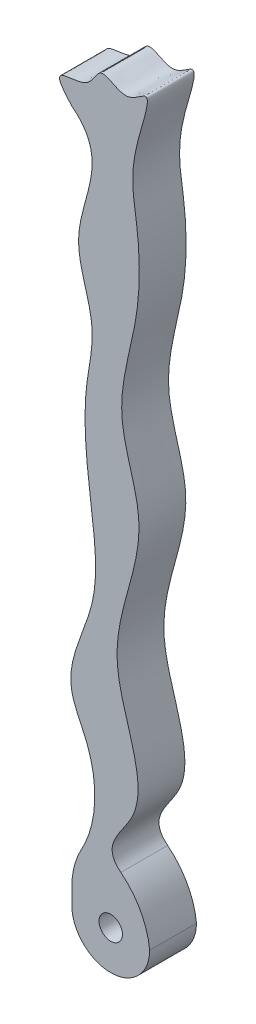
ISO-10303-21;
HEADER;
FILE_DESCRIPTION(('STEP AP214'),'2;1');
FILE_NAME('part.step','',(''),(''),'','','');
FILE_SCHEMA(('AUTOMOTIVE_DESIGN { 1 0 10303 214 1 1 1 1 }'));
ENDSEC;
DATA;
#1=APPLICATION_CONTEXT('core data for automotive mechanical design processes');
#2=APPLICATION_PROTOCOL_DEFINITION('international standard','automotive_design',2000,#1);
#3=PRODUCT_CONTEXT('',#1,'mechanical');
#4=PRODUCT('Part','Part','',(#3));
#5=PRODUCT_RELATED_PRODUCT_CATEGORY('part','',(#4));
#6=PRODUCT_DEFINITION_FORMATION('','',#4);
#7=PRODUCT_DEFINITION_CONTEXT('part definition',#1,'design');
#8=PRODUCT_DEFINITION('design','',#6,#7);
#9=PRODUCT_DEFINITION_SHAPE('','',#8);
#10=(LENGTH_UNIT() NAMED_UNIT(*) SI_UNIT(.MILLI.,.METRE.));
#11=(NAMED_UNIT(*) PLANE_ANGLE_UNIT() SI_UNIT($,.RADIAN.));
#12=(NAMED_UNIT(*) SI_UNIT($,.STERADIAN.) SOLID_ANGLE_UNIT());
#13=UNCERTAINTY_MEASURE_WITH_UNIT(LENGTH_MEASURE(1.E-05),#10,'distance_accuracy_value','');
#14=(GEOMETRIC_REPRESENTATION_CONTEXT(3) GLOBAL_UNCERTAINTY_ASSIGNED_CONTEXT((#13)) GLOBAL_UNIT_ASSIGNED_CONTEXT((#10,
#11,#12)) REPRESENTATION_CONTEXT('',''));
#15=CARTESIAN_POINT('',(0.,0.,0.));
#16=DIRECTION('',(0.,0.,1.));
#17=DIRECTION('',(1.,0.,0.));
#18=AXIS2_PLACEMENT_3D('',#15,#16,#17);
#19=CARTESIAN_POINT('',(4.07432307287909,27.0040889400727,6.));
#20=DIRECTION('',(0.,0.,1.));
#21=DIRECTION('',(1.,0.,0.));
#22=AXIS2_PLACEMENT_3D('',#19,#20,#21);
#23=PLANE('',#22);
#24=CARTESIAN_POINT('',(4.99,-4.99,6.));
#25=DIRECTION('',(0.,0.,1.));
#26=DIRECTION('',(1.,0.,0.));
#27=AXIS2_PLACEMENT_3D('',#24,#25,#26);
#28=CIRCLE('',#27,1.5);
#29=CARTESIAN_POINT('',(6.49,-4.99,6.));
#30=VERTEX_POINT('',#29);
#31=EDGE_CURVE('E205',#30,#30,#28,.T.);
#32=ORIENTED_EDGE('',*,*,#31,.F.);
#33=EDGE_LOOP('',(#32));
#34=FACE_BOUND('',#33,.T.);
#35=CARTESIAN_POINT('',(0.,83.7242318277162,6.));
#36=CARTESIAN_POINT('',(5.30360451309012,79.6275511991297,6.));
#37=CARTESIAN_POINT('',(-1.72408284275798,71.1710610888068,6.));
#38=CARTESIAN_POINT('',(3.50687172415467,61.2106332077298,6.));
#39=CARTESIAN_POINT('',(1.01260111726702,51.3203743797408,6.));
#40=CARTESIAN_POINT('',(2.48456574438665,41.1283603197757,6.));
#41=CARTESIAN_POINT('',(3.80137678876694,29.3383759104623,6.));
#42=CARTESIAN_POINT('',(-1.78831888313615,20.5922250285312,6.));
#43=CARTESIAN_POINT('',(3.99004314904156,11.2809632428831,6.));
#44=CARTESIAN_POINT('',(3.12734891819012,3.88723837993776,6.));
#45=CARTESIAN_POINT('',(0.,0.,6.));
#46=B_SPLINE_CURVE_WITH_KNOTS('',3,(#35,#36,#37,#38,#39,#40,#41,#42,#43,#44,#45),.UNSPECIFIED.,
.F.,.F.,(4,1,1,1,1,1,1,1,4),(0.,0.178407715975721,0.282250632971705,0.360012871768497,
0.523096626866461,0.638532861503322,0.770288180663963,0.82976306952161,1.),.UNSPECIFIED.);
#47=CARTESIAN_POINT('',(0.,83.7242318277162,6.));
#48=VERTEX_POINT('',#47);
#49=CARTESIAN_POINT('',(1.24333810984433,1.85583155249955,6.));
#50=VERTEX_POINT('',#49);
#51=EDGE_CURVE('E136',#48,#50,#46,.T.);
#52=ORIENTED_EDGE('',*,*,#51,.T.);
#53=CARTESIAN_POINT('',(10.,-2.97333737615631,6.));
#54=DIRECTION('',(0.,0.,1.));
#55=DIRECTION('',(1.,0.,0.));
#56=AXIS2_PLACEMENT_3D('',#53,#54,#55);
#57=CIRCLE('',#56,10.);
#58=CARTESIAN_POINT('',(0.,-2.97333737615631,6.));
#59=VERTEX_POINT('',#58);
#60=EDGE_CURVE('E63',#50,#59,#57,.T.);
#61=ORIENTED_EDGE('',*,*,#60,.T.);
#62=DIRECTION('',(0.,-1.,0.));
#63=VECTOR('',#62,1.);
#64=CARTESIAN_POINT('',(0.,0.,6.));
#65=LINE('',#64,#63);
#66=CARTESIAN_POINT('',(0.,-4.99,6.));
#67=VERTEX_POINT('',#66);
#68=EDGE_CURVE('E109',#59,#67,#65,.T.);
#69=ORIENTED_EDGE('',*,*,#68,.T.);
#70=CARTESIAN_POINT('',(4.99,-4.99,6.));
#71=DIRECTION('',(0.,0.,-1.));
#72=DIRECTION('',(-1.,0.,0.));
#73=AXIS2_PLACEMENT_3D('',#70,#71,#72);
#74=CIRCLE('',#73,4.99);
#75=CARTESIAN_POINT('',(9.98,-4.99,6.));
#76=VERTEX_POINT('',#75);
#77=EDGE_CURVE('E111',#76,#67,#74,.T.);
#78=ORIENTED_EDGE('',*,*,#77,.F.);
#79=CARTESIAN_POINT('',(0.0310108964638543,-5.99876945716995,6.));
#80=DIRECTION('',(0.,0.,1.));
#81=DIRECTION('',(1.,0.,0.));
#82=AXIS2_PLACEMENT_3D('',#79,#80,#81);
#83=CIRCLE('',#82,10.);
#84=CARTESIAN_POINT('',(6.29125303537323,1.79926672909024,6.));
#85=VERTEX_POINT('',#84);
#86=EDGE_CURVE('E70',#76,#85,#83,.T.);
#87=ORIENTED_EDGE('',*,*,#86,.T.);
#88=CARTESIAN_POINT('',(9.98,0.,6.));
#89=CARTESIAN_POINT('',(1.82735639435472,2.77603669074244,6.));
#90=CARTESIAN_POINT('',(12.6284584082559,9.59933235837442,6.));
#91=CARTESIAN_POINT('',(2.06869458009947,25.5354900622314,6.));
#92=CARTESIAN_POINT('',(11.0705962110833,39.679531963617,6.));
#93=CARTESIAN_POINT('',(4.76134769084272,53.0945780205617,6.));
#94=CARTESIAN_POINT('',(8.90482224707103,63.6142178871551,6.));
#95=CARTESIAN_POINT('',(8.63400219004494,74.9890039805902,6.));
#96=CARTESIAN_POINT('',(6.94132405017827,80.9305998095854,6.));
#97=CARTESIAN_POINT('',(10.9107914530873,91.3305026743746,6.));
#98=CARTESIAN_POINT('',(6.7403174797081,87.2564779415208,6.));
#99=CARTESIAN_POINT('',(3.67621995962517,90.4939468582485,6.));
#100=CARTESIAN_POINT('',(1.87598491500181,85.2699856212088,6.));
#101=CARTESIAN_POINT('',(-3.8601205014058,87.8931590609359,6.));
#102=CARTESIAN_POINT('',(0.,83.7242318277162,6.));
#103=B_SPLINE_CURVE_WITH_KNOTS('',3,(#88,#89,#90,#91,#92,#93,#94,#95,#96,#97,#98,#99,#100,#101,
#102),.UNSPECIFIED.,.F.,.F.,(4,1,1,1,1,1,1,1,1,1,1,1,4),(0.,0.100682732287423,0.250611548367926,
0.416415763417225,0.510336756842132,0.633096865303225,0.721240759906963,0.807038287311499,
0.861395625064534,0.884668407627723,0.916983233993869,0.938691149651532,1.),.UNSPECIFIED.);
#104=EDGE_CURVE('E143',#85,#48,#103,.T.);
#105=ORIENTED_EDGE('',*,*,#104,.T.);
#106=EDGE_LOOP('',(#52,#61,#69,#78,#87,#105));
#107=FACE_BOUND('',#106,.T.);
#108=ADVANCED_FACE('F55',(#34,#107),#23,.T.);
#109=CARTESIAN_POINT('',(4.07432307287909,27.0040889400727,0.));
#110=DIRECTION('',(0.,0.,1.));
#111=DIRECTION('',(1.,0.,0.));
#112=AXIS2_PLACEMENT_3D('',#109,#110,#111);
#113=PLANE('',#112);
#114=CARTESIAN_POINT('',(4.99,-4.99,0.));
#115=DIRECTION('',(0.,0.,1.));
#116=DIRECTION('',(1.,0.,0.));
#117=AXIS2_PLACEMENT_3D('',#114,#115,#116);
#118=CIRCLE('',#117,1.5);
#119=CARTESIAN_POINT('',(6.49,-4.99,0.));
#120=VERTEX_POINT('',#119);
#121=EDGE_CURVE('E202',#120,#120,#118,.T.);
#122=ORIENTED_EDGE('',*,*,#121,.T.);
#123=EDGE_LOOP('',(#122));
#124=FACE_BOUND('',#123,.T.);
#125=DIRECTION('',(0.,-1.,0.));
#126=VECTOR('',#125,1.);
#127=CARTESIAN_POINT('',(0.,0.,0.));
#128=LINE('',#127,#126);
#129=CARTESIAN_POINT('',(0.,-2.97333737615631,0.));
#130=VERTEX_POINT('',#129);
#131=CARTESIAN_POINT('',(0.,-4.99,0.));
#132=VERTEX_POINT('',#131);
#133=EDGE_CURVE('E118',#130,#132,#128,.T.);
#134=ORIENTED_EDGE('',*,*,#133,.F.);
#135=CARTESIAN_POINT('',(10.,-2.97333737615631,0.));
#136=DIRECTION('',(0.,0.,1.));
#137=DIRECTION('',(1.,0.,0.));
#138=AXIS2_PLACEMENT_3D('',#135,#136,#137);
#139=CIRCLE('',#138,10.);
#140=CARTESIAN_POINT('',(1.24333810984433,1.85583155249955,0.));
#141=VERTEX_POINT('',#140);
#142=EDGE_CURVE('E195',#130,#141,#139,.F.);
#143=ORIENTED_EDGE('',*,*,#142,.T.);
#144=CARTESIAN_POINT('',(0.,83.7242318277162,0.));
#145=CARTESIAN_POINT('',(5.30360451309012,79.6275511991297,0.));
#146=CARTESIAN_POINT('',(-1.72408284275798,71.1710610888068,0.));
#147=CARTESIAN_POINT('',(3.50687172415467,61.2106332077298,0.));
#148=CARTESIAN_POINT('',(1.01260111726702,51.3203743797408,0.));
#149=CARTESIAN_POINT('',(2.48456574438665,41.1283603197757,0.));
#150=CARTESIAN_POINT('',(3.80137678876694,29.3383759104623,0.));
#151=CARTESIAN_POINT('',(-1.78831888313615,20.5922250285312,0.));
#152=CARTESIAN_POINT('',(3.99004314904156,11.2809632428831,0.));
#153=CARTESIAN_POINT('',(3.12734891819012,3.88723837993776,0.));
#154=CARTESIAN_POINT('',(0.,0.,0.));
#155=B_SPLINE_CURVE_WITH_KNOTS('',3,(#144,#145,#146,#147,#148,#149,#150,#151,#152,#153,#154),
.UNSPECIFIED.,.F.,.F.,(4,1,1,1,1,1,1,1,4),(0.,0.178407715975721,0.282250632971705,
0.360012871768497,0.523096626866461,0.638532861503322,0.770288180663963,0.82976306952161,1.),.UNSPECIFIED.);
#156=CARTESIAN_POINT('',(0.,83.7242318277162,0.));
#157=VERTEX_POINT('',#156);
#158=EDGE_CURVE('E137',#157,#141,#155,.T.);
#159=ORIENTED_EDGE('',*,*,#158,.F.);
#160=CARTESIAN_POINT('',(9.98,0.,0.));
#161=CARTESIAN_POINT('',(1.82735639435472,2.77603669074244,0.));
#162=CARTESIAN_POINT('',(12.6284584082559,9.59933235837442,0.));
#163=CARTESIAN_POINT('',(2.06869458009947,25.5354900622314,0.));
#164=CARTESIAN_POINT('',(11.0705962110833,39.679531963617,0.));
#165=CARTESIAN_POINT('',(4.76134769084272,53.0945780205617,0.));
#166=CARTESIAN_POINT('',(8.90482224707103,63.6142178871551,0.));
#167=CARTESIAN_POINT('',(8.63400219004494,74.9890039805902,0.));
#168=CARTESIAN_POINT('',(6.94132405017827,80.9305998095854,0.));
#169=CARTESIAN_POINT('',(10.9107914530873,91.3305026743746,0.));
#170=CARTESIAN_POINT('',(6.7403174797081,87.2564779415208,0.));
#171=CARTESIAN_POINT('',(3.67621995962517,90.4939468582485,0.));
#172=CARTESIAN_POINT('',(1.87598491500181,85.2699856212088,0.));
#173=CARTESIAN_POINT('',(-3.8601205014058,87.8931590609359,0.));
#174=CARTESIAN_POINT('',(0.,83.7242318277162,0.));
#175=B_SPLINE_CURVE_WITH_KNOTS('',3,(#160,#161,#162,#163,#164,#165,#166,#167,#168,#169,#170,
#171,#172,#173,#174),.UNSPECIFIED.,.F.,.F.,(4,1,1,1,1,1,1,1,1,1,1,1,4),(0.,0.100682732287423,
0.250611548367926,0.416415763417225,0.510336756842132,0.633096865303225,0.721240759906963,
0.807038287311499,0.861395625064534,0.884668407627723,0.916983233993869,0.938691149651532,1.),.UNSPECIFIED.);
#176=CARTESIAN_POINT('',(6.29125303537323,1.79926672909024,0.));
#177=VERTEX_POINT('',#176);
#178=EDGE_CURVE('E142',#177,#157,#175,.T.);
#179=ORIENTED_EDGE('',*,*,#178,.F.);
#180=CARTESIAN_POINT('',(0.0310108964638543,-5.99876945716995,0.));
#181=DIRECTION('',(0.,0.,1.));
#182=DIRECTION('',(1.,0.,0.));
#183=AXIS2_PLACEMENT_3D('',#180,#181,#182);
#184=CIRCLE('',#183,10.);
#185=CARTESIAN_POINT('',(9.98,-4.99,0.));
#186=VERTEX_POINT('',#185);
#187=EDGE_CURVE('E192',#177,#186,#184,.F.);
#188=ORIENTED_EDGE('',*,*,#187,.T.);
#189=CARTESIAN_POINT('',(4.99,-4.99,0.));
#190=DIRECTION('',(0.,0.,-1.));
#191=DIRECTION('',(-1.,0.,0.));
#192=AXIS2_PLACEMENT_3D('',#189,#190,#191);
#193=CIRCLE('',#192,4.99);
#194=EDGE_CURVE('E127',#186,#132,#193,.T.);
#195=ORIENTED_EDGE('',*,*,#194,.T.);
#196=EDGE_LOOP('',(#134,#143,#159,#179,#188,#195));
#197=FACE_BOUND('',#196,.T.);
#198=ADVANCED_FACE('F164',(#124,#197),#113,.F.);
#199=CARTESIAN_POINT('',(0.,0.,6.));
#200=DIRECTION('',(1.,0.,0.));
#201=DIRECTION('',(0.,1.,0.));
#202=AXIS2_PLACEMENT_3D('',#199,#200,#201);
#203=PLANE('',#202);
#204=ORIENTED_EDGE('',*,*,#68,.F.);
#205=DIRECTION('',(0.,0.,-1.));
#206=VECTOR('',#205,1.);
#207=CARTESIAN_POINT('',(0.,-2.97333737615631,0.));
#208=LINE('',#207,#206);
#209=EDGE_CURVE('E117',#59,#130,#208,.T.);
#210=ORIENTED_EDGE('',*,*,#209,.T.);
#211=ORIENTED_EDGE('',*,*,#133,.T.);
#212=DIRECTION('',(0.,0.,-1.));
#213=VECTOR('',#212,1.);
#214=CARTESIAN_POINT('',(0.,-4.99,6.));
#215=LINE('',#214,#213);
#216=EDGE_CURVE('E124',#67,#132,#215,.T.);
#217=ORIENTED_EDGE('',*,*,#216,.F.);
#218=EDGE_LOOP('',(#204,#210,#211,#217));
#219=FACE_BOUND('',#218,.T.);
#220=ADVANCED_FACE('F129',(#219),#203,.F.);
#221=CARTESIAN_POINT('',(4.99,-4.99,6.));
#222=DIRECTION('',(0.,0.,-1.));
#223=DIRECTION('',(-1.,0.,0.));
#224=AXIS2_PLACEMENT_3D('',#221,#222,#223);
#225=CYLINDRICAL_SURFACE('',#224,1.5);
#226=ORIENTED_EDGE('',*,*,#31,.T.);
#227=EDGE_LOOP('',(#226));
#228=FACE_BOUND('',#227,.T.);
#229=ORIENTED_EDGE('',*,*,#121,.F.);
#230=EDGE_LOOP('',(#229));
#231=FACE_BOUND('',#230,.T.);
#232=ADVANCED_FACE('F157',(#228,#231),#225,.F.);
#233=DIRECTION('',(0.,0.,1.));
#234=VECTOR('',#233,1.);
#235=SURFACE_OF_LINEAR_EXTRUSION('',#155,#234);
#236=ORIENTED_EDGE('',*,*,#158,.T.);
#237=DIRECTION('',(0.,0.,1.));
#238=VECTOR('',#237,1.);
#239=CARTESIAN_POINT('',(1.24333810984443,1.85583155249975,0.));
#240=LINE('',#239,#238);
#241=EDGE_CURVE('E78',#141,#50,#240,.T.);
#242=ORIENTED_EDGE('',*,*,#241,.T.);
#243=ORIENTED_EDGE('',*,*,#51,.F.);
#244=DIRECTION('',(0.,0.,1.));
#245=VECTOR('',#244,1.);
#246=CARTESIAN_POINT('',(0.,83.7242318277162,0.));
#247=LINE('',#246,#245);
#248=EDGE_CURVE('E194',#157,#48,#247,.T.);
#249=ORIENTED_EDGE('',*,*,#248,.F.);
#250=EDGE_LOOP('',(#236,#242,#243,#249));
#251=FACE_BOUND('',#250,.T.);
#252=ADVANCED_FACE('F152',(#251),#235,.T.);
#253=DIRECTION('',(0.,0.,1.));
#254=VECTOR('',#253,1.);
#255=SURFACE_OF_LINEAR_EXTRUSION('',#175,#254);
#256=ORIENTED_EDGE('',*,*,#104,.F.);
#257=DIRECTION('',(0.,0.,1.));
#258=VECTOR('',#257,1.);
#259=CARTESIAN_POINT('',(6.29125303537323,1.79926672909024,6.));
#260=LINE('',#259,#258);
#261=EDGE_CURVE('E12',#85,#177,#260,.F.);
#262=ORIENTED_EDGE('',*,*,#261,.T.);
#263=ORIENTED_EDGE('',*,*,#178,.T.);
#264=ORIENTED_EDGE('',*,*,#248,.T.);
#265=EDGE_LOOP('',(#256,#262,#263,#264));
#266=FACE_BOUND('',#265,.T.);
#267=ADVANCED_FACE('F156',(#266),#255,.T.);
#268=CARTESIAN_POINT('',(4.99,-4.99,6.));
#269=DIRECTION('',(0.,0.,-1.));
#270=DIRECTION('',(-1.,0.,0.));
#271=AXIS2_PLACEMENT_3D('',#268,#269,#270);
#272=CYLINDRICAL_SURFACE('',#271,4.99);
#273=ORIENTED_EDGE('',*,*,#194,.F.);
#274=DIRECTION('',(0.,0.,-1.));
#275=VECTOR('',#274,1.);
#276=CARTESIAN_POINT('',(9.98,-4.99,6.));
#277=LINE('',#276,#275);
#278=EDGE_CURVE('E126',#76,#186,#277,.T.);
#279=ORIENTED_EDGE('',*,*,#278,.F.);
#280=ORIENTED_EDGE('',*,*,#77,.T.);
#281=ORIENTED_EDGE('',*,*,#216,.T.);
#282=EDGE_LOOP('',(#273,#279,#280,#281));
#283=FACE_BOUND('',#282,.T.);
#284=ADVANCED_FACE('F123',(#283),#272,.T.);
#285=CARTESIAN_POINT('',(10.,-2.97333737615631,3.));
#286=DIRECTION('',(0.,0.,1.));
#287=DIRECTION('',(1.,0.,0.));
#288=AXIS2_PLACEMENT_3D('',#285,#286,#287);
#289=CYLINDRICAL_SURFACE('',#288,10.);
#290=ORIENTED_EDGE('',*,*,#60,.F.);
#291=ORIENTED_EDGE('',*,*,#241,.F.);
#292=ORIENTED_EDGE('',*,*,#142,.F.);
#293=ORIENTED_EDGE('',*,*,#209,.F.);
#294=EDGE_LOOP('',(#290,#291,#292,#293));
#295=FACE_BOUND('',#294,.T.);
#296=ADVANCED_FACE('F170',(#295),#289,.T.);
#297=CARTESIAN_POINT('',(0.0310108964638543,-5.99876945716995,3.));
#298=DIRECTION('',(0.,0.,1.));
#299=DIRECTION('',(1.,0.,0.));
#300=AXIS2_PLACEMENT_3D('',#297,#298,#299);
#301=CYLINDRICAL_SURFACE('',#300,10.);
#302=ORIENTED_EDGE('',*,*,#86,.F.);
#303=ORIENTED_EDGE('',*,*,#278,.T.);
#304=ORIENTED_EDGE('',*,*,#187,.F.);
#305=ORIENTED_EDGE('',*,*,#261,.F.);
#306=EDGE_LOOP('',(#302,#303,#304,#305));
#307=FACE_BOUND('',#306,.T.);
#308=ADVANCED_FACE('F57',(#307),#301,.T.);
#309=CLOSED_SHELL('',(#108,#198,#220,#232,#252,#267,#284,#296,#308));
#310=MANIFOLD_SOLID_BREP('B2',#309);
#311=ADVANCED_BREP_SHAPE_REPRESENTATION('',(#18,#310),#14);
#312=SHAPE_DEFINITION_REPRESENTATION(#9,#311);
ENDSEC;
END-ISO-10303-21;
